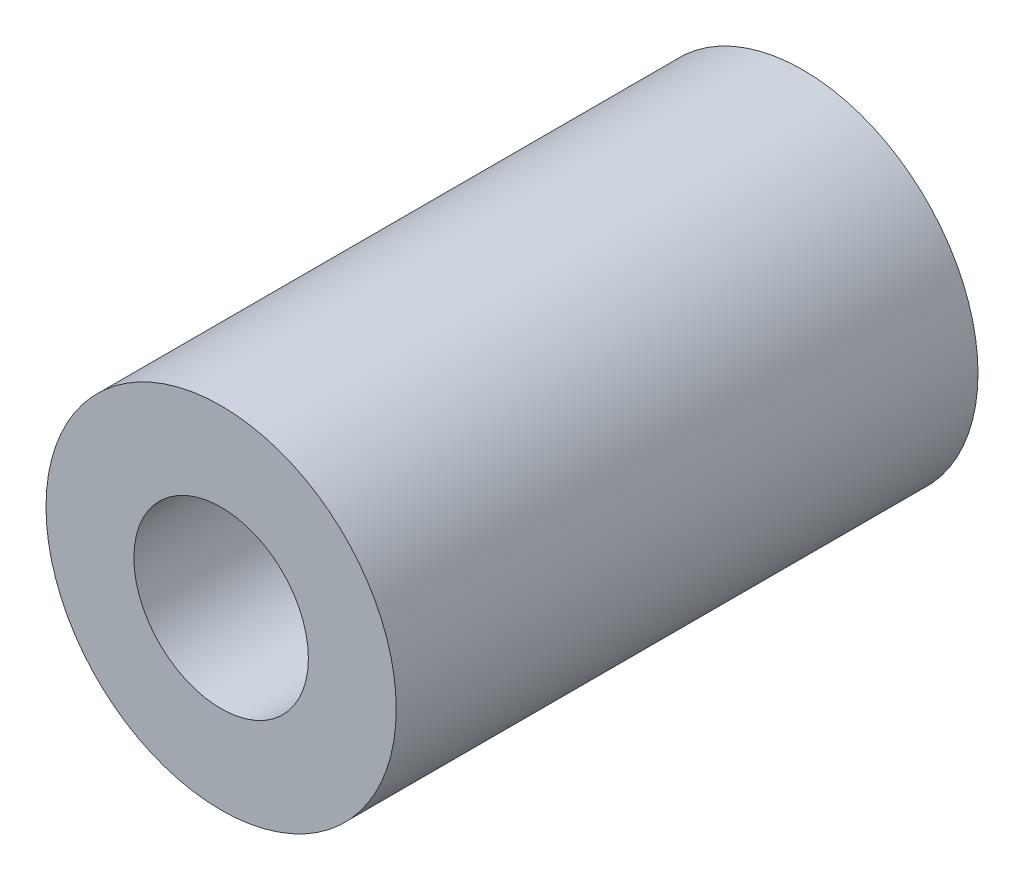
ISO-10303-21;
HEADER;
FILE_DESCRIPTION(('STEP AP214'),'2;1');
FILE_NAME('part.step','',(''),(''),'','','');
FILE_SCHEMA(('AUTOMOTIVE_DESIGN { 1 0 10303 214 1 1 1 1 }'));
ENDSEC;
DATA;
#1=APPLICATION_CONTEXT('core data for automotive mechanical design processes');
#2=APPLICATION_PROTOCOL_DEFINITION('international standard','automotive_design',2000,#1);
#3=PRODUCT_CONTEXT('',#1,'mechanical');
#4=PRODUCT('Part','Part','',(#3));
#5=PRODUCT_RELATED_PRODUCT_CATEGORY('part','',(#4));
#6=PRODUCT_DEFINITION_FORMATION('','',#4);
#7=PRODUCT_DEFINITION_CONTEXT('part definition',#1,'design');
#8=PRODUCT_DEFINITION('design','',#6,#7);
#9=PRODUCT_DEFINITION_SHAPE('','',#8);
#10=(LENGTH_UNIT() NAMED_UNIT(*) SI_UNIT(.MILLI.,.METRE.));
#11=(NAMED_UNIT(*) PLANE_ANGLE_UNIT() SI_UNIT($,.RADIAN.));
#12=(NAMED_UNIT(*) SI_UNIT($,.STERADIAN.) SOLID_ANGLE_UNIT());
#13=UNCERTAINTY_MEASURE_WITH_UNIT(LENGTH_MEASURE(1.E-05),#10,'distance_accuracy_value','');
#14=(GEOMETRIC_REPRESENTATION_CONTEXT(3) GLOBAL_UNCERTAINTY_ASSIGNED_CONTEXT((#13)) GLOBAL_UNIT_ASSIGNED_CONTEXT((#10,
#11,#12)) REPRESENTATION_CONTEXT('',''));
#15=CARTESIAN_POINT('',(0.,0.,0.));
#16=DIRECTION('',(0.,0.,1.));
#17=DIRECTION('',(1.,0.,0.));
#18=AXIS2_PLACEMENT_3D('',#15,#16,#17);
#19=CARTESIAN_POINT('',(0.,0.,5.));
#20=DIRECTION('',(0.,0.,1.));
#21=DIRECTION('',(1.,0.,0.));
#22=AXIS2_PLACEMENT_3D('',#19,#20,#21);
#23=PLANE('',#22);
#24=CARTESIAN_POINT('',(0.,0.,5.));
#25=DIRECTION('',(0.,0.,1.));
#26=DIRECTION('',(1.,0.,0.));
#27=AXIS2_PLACEMENT_3D('',#24,#25,#26);
#28=CIRCLE('',#27,3.01);
#29=CARTESIAN_POINT('',(3.01,0.,5.));
#30=VERTEX_POINT('',#29);
#31=EDGE_CURVE('E10',#30,#30,#28,.T.);
#32=ORIENTED_EDGE('',*,*,#31,.T.);
#33=EDGE_LOOP('',(#32));
#34=FACE_BOUND('',#33,.T.);
#35=CARTESIAN_POINT('',(0.,0.,5.));
#36=DIRECTION('',(0.,0.,1.));
#37=DIRECTION('',(1.,0.,0.));
#38=AXIS2_PLACEMENT_3D('',#35,#36,#37);
#39=CIRCLE('',#38,1.5);
#40=CARTESIAN_POINT('',(1.5,0.,5.));
#41=VERTEX_POINT('',#40);
#42=EDGE_CURVE('E43',#41,#41,#39,.T.);
#43=ORIENTED_EDGE('',*,*,#42,.F.);
#44=EDGE_LOOP('',(#43));
#45=FACE_BOUND('',#44,.T.);
#46=ADVANCED_FACE('F32',(#34,#45),#23,.T.);
#47=CARTESIAN_POINT('',(0.,0.,-5.));
#48=DIRECTION('',(0.,0.,1.));
#49=DIRECTION('',(1.,0.,0.));
#50=AXIS2_PLACEMENT_3D('',#47,#48,#49);
#51=PLANE('',#50);
#52=CARTESIAN_POINT('',(0.,0.,-5.));
#53=DIRECTION('',(0.,0.,1.));
#54=DIRECTION('',(1.,0.,0.));
#55=AXIS2_PLACEMENT_3D('',#52,#53,#54);
#56=CIRCLE('',#55,3.01);
#57=CARTESIAN_POINT('',(3.01,0.,-5.));
#58=VERTEX_POINT('',#57);
#59=EDGE_CURVE('E36',#58,#58,#56,.T.);
#60=ORIENTED_EDGE('',*,*,#59,.F.);
#61=EDGE_LOOP('',(#60));
#62=FACE_BOUND('',#61,.T.);
#63=CARTESIAN_POINT('',(0.,0.,-5.));
#64=DIRECTION('',(0.,0.,1.));
#65=DIRECTION('',(1.,0.,0.));
#66=AXIS2_PLACEMENT_3D('',#63,#64,#65);
#67=CIRCLE('',#66,1.5);
#68=CARTESIAN_POINT('',(1.5,0.,-5.));
#69=VERTEX_POINT('',#68);
#70=EDGE_CURVE('E45',#69,#69,#67,.T.);
#71=ORIENTED_EDGE('',*,*,#70,.T.);
#72=EDGE_LOOP('',(#71));
#73=FACE_BOUND('',#72,.T.);
#74=ADVANCED_FACE('F55',(#62,#73),#51,.F.);
#75=CARTESIAN_POINT('',(0.,0.,5.));
#76=DIRECTION('',(0.,0.,-1.));
#77=DIRECTION('',(-1.,0.,0.));
#78=AXIS2_PLACEMENT_3D('',#75,#76,#77);
#79=CYLINDRICAL_SURFACE('',#78,3.01);
#80=ORIENTED_EDGE('',*,*,#31,.F.);
#81=EDGE_LOOP('',(#80));
#82=FACE_BOUND('',#81,.T.);
#83=ORIENTED_EDGE('',*,*,#59,.T.);
#84=EDGE_LOOP('',(#83));
#85=FACE_BOUND('',#84,.T.);
#86=ADVANCED_FACE('F34',(#82,#85),#79,.T.);
#87=CARTESIAN_POINT('',(0.,0.,5.));
#88=DIRECTION('',(0.,0.,-1.));
#89=DIRECTION('',(-1.,0.,0.));
#90=AXIS2_PLACEMENT_3D('',#87,#88,#89);
#91=CYLINDRICAL_SURFACE('',#90,1.5);
#92=ORIENTED_EDGE('',*,*,#42,.T.);
#93=EDGE_LOOP('',(#92));
#94=FACE_BOUND('',#93,.T.);
#95=ORIENTED_EDGE('',*,*,#70,.F.);
#96=EDGE_LOOP('',(#95));
#97=FACE_BOUND('',#96,.T.);
#98=ADVANCED_FACE('F51',(#94,#97),#91,.F.);
#99=CLOSED_SHELL('',(#46,#74,#86,#98));
#100=MANIFOLD_SOLID_BREP('B2',#99);
#101=ADVANCED_BREP_SHAPE_REPRESENTATION('',(#18,#100),#14);
#102=SHAPE_DEFINITION_REPRESENTATION(#9,#101);
ENDSEC;
END-ISO-10303-21;
